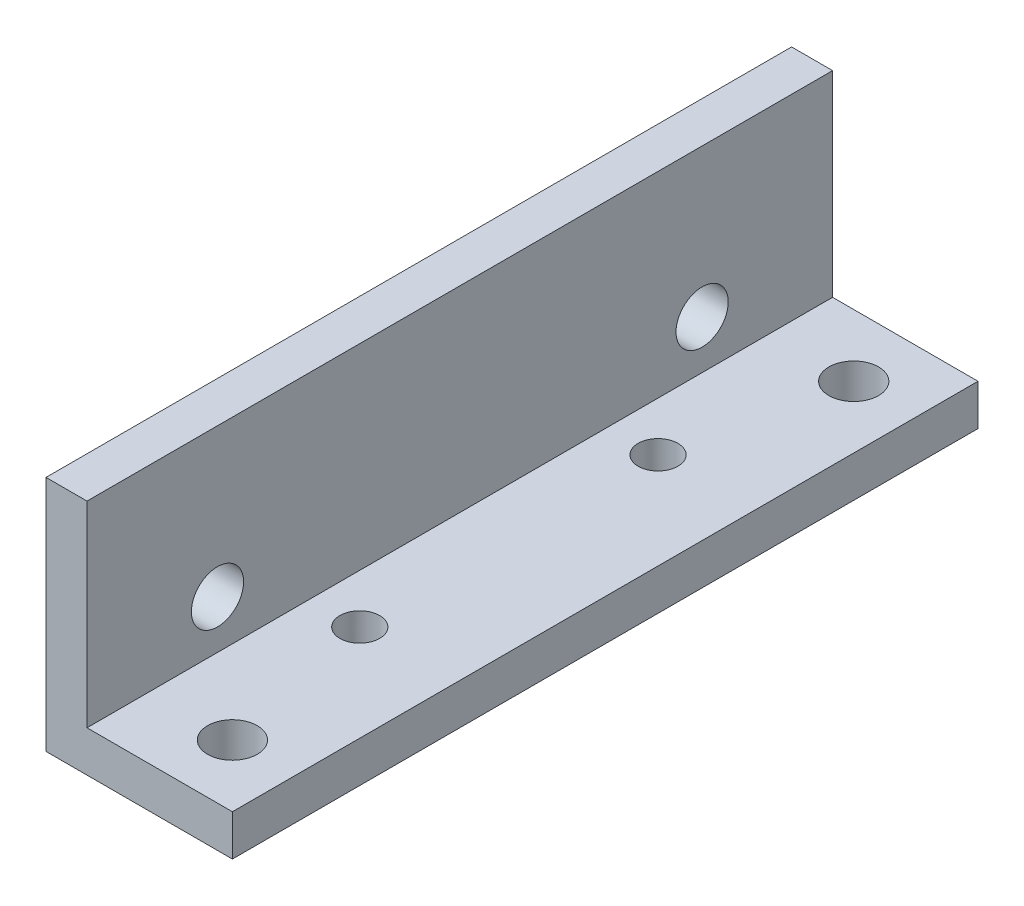
ISO-10303-21;
HEADER;
FILE_DESCRIPTION(('STEP AP214'),'2;1');
FILE_NAME('part.step','',(''),(''),'','','');
FILE_SCHEMA(('AUTOMOTIVE_DESIGN { 1 0 10303 214 1 1 1 1 }'));
ENDSEC;
DATA;
#1=APPLICATION_CONTEXT('core data for automotive mechanical design processes');
#2=APPLICATION_PROTOCOL_DEFINITION('international standard','automotive_design',2000,#1);
#3=PRODUCT_CONTEXT('',#1,'mechanical');
#4=PRODUCT('Part','Part','',(#3));
#5=PRODUCT_RELATED_PRODUCT_CATEGORY('part','',(#4));
#6=PRODUCT_DEFINITION_FORMATION('','',#4);
#7=PRODUCT_DEFINITION_CONTEXT('part definition',#1,'design');
#8=PRODUCT_DEFINITION('design','',#6,#7);
#9=PRODUCT_DEFINITION_SHAPE('','',#8);
#10=(LENGTH_UNIT() NAMED_UNIT(*) SI_UNIT(.MILLI.,.METRE.));
#11=(NAMED_UNIT(*) PLANE_ANGLE_UNIT() SI_UNIT($,.RADIAN.));
#12=(NAMED_UNIT(*) SI_UNIT($,.STERADIAN.) SOLID_ANGLE_UNIT());
#13=UNCERTAINTY_MEASURE_WITH_UNIT(LENGTH_MEASURE(1.E-05),#10,'distance_accuracy_value','');
#14=(GEOMETRIC_REPRESENTATION_CONTEXT(3) GLOBAL_UNCERTAINTY_ASSIGNED_CONTEXT((#13)) GLOBAL_UNIT_ASSIGNED_CONTEXT((#10,
#11,#12)) REPRESENTATION_CONTEXT('',''));
#15=CARTESIAN_POINT('',(0.,0.,0.));
#16=DIRECTION('',(0.,0.,1.));
#17=DIRECTION('',(1.,0.,0.));
#18=AXIS2_PLACEMENT_3D('',#15,#16,#17);
#19=CARTESIAN_POINT('',(19.1,0.,30.));
#20=DIRECTION('',(0.,1.,0.));
#21=DIRECTION('',(-1.,0.,0.));
#22=AXIS2_PLACEMENT_3D('',#19,#20,#21);
#23=PLANE('',#22);
#24=CARTESIAN_POINT('',(7.24999999999996,0.,11.9999999999999));
#25=DIRECTION('',(0.,-1.,0.));
#26=DIRECTION('',(1.,0.,0.));
#27=AXIS2_PLACEMENT_3D('',#24,#25,#26);
#28=CIRCLE('',#27,1.6);
#29=CARTESIAN_POINT('',(8.84999999999997,0.,11.9999999999999));
#30=VERTEX_POINT('',#29);
#31=EDGE_CURVE('E146',#30,#30,#28,.T.);
#32=ORIENTED_EDGE('',*,*,#31,.F.);
#33=EDGE_LOOP('',(#32));
#34=FACE_BOUND('',#33,.T.);
#35=CARTESIAN_POINT('',(7.24999999999992,0.,-12.0000000000001));
#36=DIRECTION('',(0.,-1.,0.));
#37=DIRECTION('',(1.,0.,0.));
#38=AXIS2_PLACEMENT_3D('',#35,#36,#37);
#39=CIRCLE('',#38,1.6);
#40=CARTESIAN_POINT('',(8.84999999999992,0.,-12.0000000000001));
#41=VERTEX_POINT('',#40);
#42=EDGE_CURVE('E135',#41,#41,#39,.T.);
#43=ORIENTED_EDGE('',*,*,#42,.F.);
#44=EDGE_LOOP('',(#43));
#45=FACE_BOUND('',#44,.T.);
#46=CARTESIAN_POINT('',(10.,0.,-25.));
#47=DIRECTION('',(0.,-1.,0.));
#48=DIRECTION('',(0.,0.,-1.));
#49=AXIS2_PLACEMENT_3D('',#46,#47,#48);
#50=CIRCLE('',#49,2.);
#51=CARTESIAN_POINT('',(10.,0.,-27.));
#52=VERTEX_POINT('',#51);
#53=EDGE_CURVE('E151',#52,#52,#50,.T.);
#54=ORIENTED_EDGE('',*,*,#53,.F.);
#55=EDGE_LOOP('',(#54));
#56=FACE_BOUND('',#55,.T.);
#57=DIRECTION('',(1.,0.,0.));
#58=VECTOR('',#57,1.);
#59=CARTESIAN_POINT('',(19.1,0.,-30.));
#60=LINE('',#59,#58);
#61=CARTESIAN_POINT('',(0.,0.,-30.));
#62=VERTEX_POINT('',#61);
#63=CARTESIAN_POINT('',(15.,0.,-30.));
#64=VERTEX_POINT('',#63);
#65=EDGE_CURVE('E103',#62,#64,#60,.T.);
#66=ORIENTED_EDGE('',*,*,#65,.T.);
#67=DIRECTION('',(0.,0.,-1.));
#68=VECTOR('',#67,1.);
#69=CARTESIAN_POINT('',(15.,0.,30.));
#70=LINE('',#69,#68);
#71=CARTESIAN_POINT('',(15.,0.,30.));
#72=VERTEX_POINT('',#71);
#73=EDGE_CURVE('E47',#72,#64,#70,.T.);
#74=ORIENTED_EDGE('',*,*,#73,.F.);
#75=DIRECTION('',(1.,0.,0.));
#76=VECTOR('',#75,1.);
#77=CARTESIAN_POINT('',(19.1,0.,30.));
#78=LINE('',#77,#76);
#79=CARTESIAN_POINT('',(0.,0.,30.));
#80=VERTEX_POINT('',#79);
#81=EDGE_CURVE('E101',#80,#72,#78,.T.);
#82=ORIENTED_EDGE('',*,*,#81,.F.);
#83=DIRECTION('',(0.,0.,-1.));
#84=VECTOR('',#83,1.);
#85=CARTESIAN_POINT('',(0.,0.,30.));
#86=LINE('',#85,#84);
#87=EDGE_CURVE('E118',#80,#62,#86,.T.);
#88=ORIENTED_EDGE('',*,*,#87,.T.);
#89=EDGE_LOOP('',(#66,#74,#82,#88));
#90=FACE_BOUND('',#89,.T.);
#91=CARTESIAN_POINT('',(10.,0.,25.));
#92=DIRECTION('',(0.,-1.,0.));
#93=DIRECTION('',(0.,0.,-1.));
#94=AXIS2_PLACEMENT_3D('',#91,#92,#93);
#95=CIRCLE('',#94,2.);
#96=CARTESIAN_POINT('',(10.,0.,23.));
#97=VERTEX_POINT('',#96);
#98=EDGE_CURVE('E134',#97,#97,#95,.T.);
#99=ORIENTED_EDGE('',*,*,#98,.F.);
#100=EDGE_LOOP('',(#99));
#101=FACE_BOUND('',#100,.T.);
#102=ADVANCED_FACE('F32',(#34,#45,#56,#90,#101),#23,.F.);
#103=CARTESIAN_POINT('',(3.3,3.3,30.));
#104=DIRECTION('',(0.,-1.,0.));
#105=DIRECTION('',(0.,0.,-1.));
#106=AXIS2_PLACEMENT_3D('',#103,#104,#105);
#107=PLANE('',#106);
#108=CARTESIAN_POINT('',(7.24999999999996,3.3,11.9999999999999));
#109=DIRECTION('',(0.,-1.,0.));
#110=DIRECTION('',(0.,0.,-1.));
#111=AXIS2_PLACEMENT_3D('',#108,#109,#110);
#112=CIRCLE('',#111,1.6);
#113=CARTESIAN_POINT('',(7.24999999999996,3.3,10.3999999999999));
#114=VERTEX_POINT('',#113);
#115=EDGE_CURVE('E35',#114,#114,#112,.T.);
#116=ORIENTED_EDGE('',*,*,#115,.T.);
#117=EDGE_LOOP('',(#116));
#118=FACE_BOUND('',#117,.T.);
#119=CARTESIAN_POINT('',(7.24999999999992,3.3,-12.0000000000001));
#120=DIRECTION('',(0.,-1.,0.));
#121=DIRECTION('',(0.,0.,-1.));
#122=AXIS2_PLACEMENT_3D('',#119,#120,#121);
#123=CIRCLE('',#122,1.6);
#124=CARTESIAN_POINT('',(7.24999999999992,3.3,-13.6000000000001));
#125=VERTEX_POINT('',#124);
#126=EDGE_CURVE('E132',#125,#125,#123,.T.);
#127=ORIENTED_EDGE('',*,*,#126,.T.);
#128=EDGE_LOOP('',(#127));
#129=FACE_BOUND('',#128,.T.);
#130=CARTESIAN_POINT('',(10.,3.3,25.));
#131=DIRECTION('',(0.,-1.,0.));
#132=DIRECTION('',(0.,0.,-1.));
#133=AXIS2_PLACEMENT_3D('',#130,#131,#132);
#134=CIRCLE('',#133,2.);
#135=CARTESIAN_POINT('',(10.,3.3,23.));
#136=VERTEX_POINT('',#135);
#137=EDGE_CURVE('E139',#136,#136,#134,.T.);
#138=ORIENTED_EDGE('',*,*,#137,.T.);
#139=EDGE_LOOP('',(#138));
#140=FACE_BOUND('',#139,.T.);
#141=CARTESIAN_POINT('',(10.,3.3,-25.));
#142=DIRECTION('',(0.,-1.,0.));
#143=DIRECTION('',(0.,0.,-1.));
#144=AXIS2_PLACEMENT_3D('',#141,#142,#143);
#145=CIRCLE('',#144,2.);
#146=CARTESIAN_POINT('',(10.,3.3,-27.));
#147=VERTEX_POINT('',#146);
#148=EDGE_CURVE('E154',#147,#147,#145,.T.);
#149=ORIENTED_EDGE('',*,*,#148,.T.);
#150=EDGE_LOOP('',(#149));
#151=FACE_BOUND('',#150,.T.);
#152=DIRECTION('',(-1.,0.,0.));
#153=VECTOR('',#152,1.);
#154=CARTESIAN_POINT('',(3.3,3.3,30.));
#155=LINE('',#154,#153);
#156=CARTESIAN_POINT('',(15.,3.3,30.));
#157=VERTEX_POINT('',#156);
#158=CARTESIAN_POINT('',(3.3,3.3,30.));
#159=VERTEX_POINT('',#158);
#160=EDGE_CURVE('E84',#157,#159,#155,.T.);
#161=ORIENTED_EDGE('',*,*,#160,.F.);
#162=DIRECTION('',(0.,0.,-1.));
#163=VECTOR('',#162,1.);
#164=CARTESIAN_POINT('',(15.,3.3,30.));
#165=LINE('',#164,#163);
#166=CARTESIAN_POINT('',(15.,3.3,-30.));
#167=VERTEX_POINT('',#166);
#168=EDGE_CURVE('E95',#157,#167,#165,.T.);
#169=ORIENTED_EDGE('',*,*,#168,.T.);
#170=DIRECTION('',(-1.,0.,0.));
#171=VECTOR('',#170,1.);
#172=CARTESIAN_POINT('',(3.3,3.3,-30.));
#173=LINE('',#172,#171);
#174=CARTESIAN_POINT('',(3.3,3.3,-30.));
#175=VERTEX_POINT('',#174);
#176=EDGE_CURVE('E120',#167,#175,#173,.T.);
#177=ORIENTED_EDGE('',*,*,#176,.T.);
#178=DIRECTION('',(0.,0.,-1.));
#179=VECTOR('',#178,1.);
#180=CARTESIAN_POINT('',(3.3,3.3,30.));
#181=LINE('',#180,#179);
#182=EDGE_CURVE('E40',#159,#175,#181,.T.);
#183=ORIENTED_EDGE('',*,*,#182,.F.);
#184=EDGE_LOOP('',(#161,#169,#177,#183));
#185=FACE_BOUND('',#184,.T.);
#186=ADVANCED_FACE('F187',(#118,#129,#140,#151,#185),#107,.F.);
#187=CARTESIAN_POINT('',(3.3,19.1,30.));
#188=DIRECTION('',(-1.,0.,0.));
#189=DIRECTION('',(0.,-1.,0.));
#190=AXIS2_PLACEMENT_3D('',#187,#188,#189);
#191=PLANE('',#190);
#192=CARTESIAN_POINT('',(3.3,7.18,-19.5));
#193=DIRECTION('',(-1.,0.,0.));
#194=DIRECTION('',(0.,-1.,0.));
#195=AXIS2_PLACEMENT_3D('',#192,#193,#194);
#196=CIRCLE('',#195,2.09999999999999);
#197=CARTESIAN_POINT('',(3.3,5.08000000000001,-19.5));
#198=VERTEX_POINT('',#197);
#199=EDGE_CURVE('E160',#198,#198,#196,.T.);
#200=ORIENTED_EDGE('',*,*,#199,.T.);
#201=EDGE_LOOP('',(#200));
#202=FACE_BOUND('',#201,.T.);
#203=CARTESIAN_POINT('',(3.3,7.18,19.5));
#204=DIRECTION('',(-1.,0.,0.));
#205=DIRECTION('',(0.,-1.,0.));
#206=AXIS2_PLACEMENT_3D('',#203,#204,#205);
#207=CIRCLE('',#206,2.09999999999999);
#208=CARTESIAN_POINT('',(3.3,5.08000000000001,19.5));
#209=VERTEX_POINT('',#208);
#210=EDGE_CURVE('E104',#209,#209,#207,.T.);
#211=ORIENTED_EDGE('',*,*,#210,.T.);
#212=EDGE_LOOP('',(#211));
#213=FACE_BOUND('',#212,.T.);
#214=DIRECTION('',(0.,1.,0.));
#215=VECTOR('',#214,1.);
#216=CARTESIAN_POINT('',(3.3,19.1,-30.));
#217=LINE('',#216,#215);
#218=CARTESIAN_POINT('',(3.3,19.1,-30.));
#219=VERTEX_POINT('',#218);
#220=EDGE_CURVE('E122',#175,#219,#217,.T.);
#221=ORIENTED_EDGE('',*,*,#220,.T.);
#222=DIRECTION('',(0.,0.,-1.));
#223=VECTOR('',#222,1.);
#224=CARTESIAN_POINT('',(3.3,19.1,30.));
#225=LINE('',#224,#223);
#226=CARTESIAN_POINT('',(3.3,19.1,30.));
#227=VERTEX_POINT('',#226);
#228=EDGE_CURVE('E128',#227,#219,#225,.T.);
#229=ORIENTED_EDGE('',*,*,#228,.F.);
#230=DIRECTION('',(0.,1.,0.));
#231=VECTOR('',#230,1.);
#232=CARTESIAN_POINT('',(3.3,19.1,30.));
#233=LINE('',#232,#231);
#234=EDGE_CURVE('E108',#159,#227,#233,.T.);
#235=ORIENTED_EDGE('',*,*,#234,.F.);
#236=ORIENTED_EDGE('',*,*,#182,.T.);
#237=EDGE_LOOP('',(#221,#229,#235,#236));
#238=FACE_BOUND('',#237,.T.);
#239=ADVANCED_FACE('F169',(#202,#213,#238),#191,.F.);
#240=CARTESIAN_POINT('',(0.,19.1,30.));
#241=DIRECTION('',(0.,-1.,0.));
#242=DIRECTION('',(0.,0.,-1.));
#243=AXIS2_PLACEMENT_3D('',#240,#241,#242);
#244=PLANE('',#243);
#245=DIRECTION('',(-1.,0.,0.));
#246=VECTOR('',#245,1.);
#247=CARTESIAN_POINT('',(0.,19.1,-30.));
#248=LINE('',#247,#246);
#249=CARTESIAN_POINT('',(0.,19.1,-30.));
#250=VERTEX_POINT('',#249);
#251=EDGE_CURVE('E110',#219,#250,#248,.T.);
#252=ORIENTED_EDGE('',*,*,#251,.T.);
#253=DIRECTION('',(0.,0.,-1.));
#254=VECTOR('',#253,1.);
#255=CARTESIAN_POINT('',(0.,19.1,30.));
#256=LINE('',#255,#254);
#257=CARTESIAN_POINT('',(0.,19.1,30.));
#258=VERTEX_POINT('',#257);
#259=EDGE_CURVE('E126',#258,#250,#256,.T.);
#260=ORIENTED_EDGE('',*,*,#259,.F.);
#261=DIRECTION('',(-1.,0.,0.));
#262=VECTOR('',#261,1.);
#263=CARTESIAN_POINT('',(0.,19.1,30.));
#264=LINE('',#263,#262);
#265=EDGE_CURVE('E115',#227,#258,#264,.T.);
#266=ORIENTED_EDGE('',*,*,#265,.F.);
#267=ORIENTED_EDGE('',*,*,#228,.T.);
#268=EDGE_LOOP('',(#252,#260,#266,#267));
#269=FACE_BOUND('',#268,.T.);
#270=ADVANCED_FACE('F231',(#269),#244,.F.);
#271=CARTESIAN_POINT('',(0.,0.,30.));
#272=DIRECTION('',(1.,0.,0.));
#273=DIRECTION('',(0.,0.,-1.));
#274=AXIS2_PLACEMENT_3D('',#271,#272,#273);
#275=PLANE('',#274);
#276=CARTESIAN_POINT('',(0.,7.18,-19.5));
#277=DIRECTION('',(-1.,0.,0.));
#278=DIRECTION('',(0.,0.,1.));
#279=AXIS2_PLACEMENT_3D('',#276,#277,#278);
#280=CIRCLE('',#279,2.09999999999999);
#281=CARTESIAN_POINT('',(0.,7.18,-17.4));
#282=VERTEX_POINT('',#281);
#283=EDGE_CURVE('E157',#282,#282,#280,.T.);
#284=ORIENTED_EDGE('',*,*,#283,.F.);
#285=EDGE_LOOP('',(#284));
#286=FACE_BOUND('',#285,.T.);
#287=CARTESIAN_POINT('',(0.,7.18,19.5));
#288=DIRECTION('',(-1.,0.,0.));
#289=DIRECTION('',(0.,0.,1.));
#290=AXIS2_PLACEMENT_3D('',#287,#288,#289);
#291=CIRCLE('',#290,2.09999999999999);
#292=CARTESIAN_POINT('',(0.,7.18,21.6));
#293=VERTEX_POINT('',#292);
#294=EDGE_CURVE('E163',#293,#293,#291,.T.);
#295=ORIENTED_EDGE('',*,*,#294,.F.);
#296=EDGE_LOOP('',(#295));
#297=FACE_BOUND('',#296,.T.);
#298=DIRECTION('',(0.,-1.,0.));
#299=VECTOR('',#298,1.);
#300=CARTESIAN_POINT('',(0.,0.,-30.));
#301=LINE('',#300,#299);
#302=EDGE_CURVE('E77',#250,#62,#301,.T.);
#303=ORIENTED_EDGE('',*,*,#302,.T.);
#304=ORIENTED_EDGE('',*,*,#87,.F.);
#305=DIRECTION('',(0.,-1.,0.));
#306=VECTOR('',#305,1.);
#307=CARTESIAN_POINT('',(0.,0.,30.));
#308=LINE('',#307,#306);
#309=EDGE_CURVE('E56',#258,#80,#308,.T.);
#310=ORIENTED_EDGE('',*,*,#309,.F.);
#311=ORIENTED_EDGE('',*,*,#259,.T.);
#312=EDGE_LOOP('',(#303,#304,#310,#311));
#313=FACE_BOUND('',#312,.T.);
#314=ADVANCED_FACE('F233',(#286,#297,#313),#275,.F.);
#315=CARTESIAN_POINT('',(0.,0.,30.));
#316=DIRECTION('',(0.,0.,-1.));
#317=DIRECTION('',(-1.,0.,0.));
#318=AXIS2_PLACEMENT_3D('',#315,#316,#317);
#319=PLANE('',#318);
#320=ORIENTED_EDGE('',*,*,#81,.T.);
#321=DIRECTION('',(0.,-1.,0.));
#322=VECTOR('',#321,1.);
#323=CARTESIAN_POINT('',(15.,19.1,30.));
#324=LINE('',#323,#322);
#325=EDGE_CURVE('E92',#157,#72,#324,.T.);
#326=ORIENTED_EDGE('',*,*,#325,.F.);
#327=ORIENTED_EDGE('',*,*,#160,.T.);
#328=ORIENTED_EDGE('',*,*,#234,.T.);
#329=ORIENTED_EDGE('',*,*,#265,.T.);
#330=ORIENTED_EDGE('',*,*,#309,.T.);
#331=EDGE_LOOP('',(#320,#326,#327,#328,#329,#330));
#332=FACE_BOUND('',#331,.T.);
#333=ADVANCED_FACE('F106',(#332),#319,.F.);
#334=CARTESIAN_POINT('',(0.,0.,-30.));
#335=DIRECTION('',(0.,0.,-1.));
#336=DIRECTION('',(-1.,0.,0.));
#337=AXIS2_PLACEMENT_3D('',#334,#335,#336);
#338=PLANE('',#337);
#339=DIRECTION('',(0.,1.,0.));
#340=VECTOR('',#339,1.);
#341=CARTESIAN_POINT('',(15.,0.,-30.));
#342=LINE('',#341,#340);
#343=EDGE_CURVE('E11',#64,#167,#342,.T.);
#344=ORIENTED_EDGE('',*,*,#343,.F.);
#345=ORIENTED_EDGE('',*,*,#65,.F.);
#346=ORIENTED_EDGE('',*,*,#302,.F.);
#347=ORIENTED_EDGE('',*,*,#251,.F.);
#348=ORIENTED_EDGE('',*,*,#220,.F.);
#349=ORIENTED_EDGE('',*,*,#176,.F.);
#350=EDGE_LOOP('',(#344,#345,#346,#347,#348,#349));
#351=FACE_BOUND('',#350,.T.);
#352=ADVANCED_FACE('F184',(#351),#338,.T.);
#353=CARTESIAN_POINT('',(15.,19.1,30.));
#354=DIRECTION('',(-1.,0.,0.));
#355=DIRECTION('',(0.,0.,1.));
#356=AXIS2_PLACEMENT_3D('',#353,#354,#355);
#357=PLANE('',#356);
#358=ORIENTED_EDGE('',*,*,#325,.T.);
#359=ORIENTED_EDGE('',*,*,#73,.T.);
#360=ORIENTED_EDGE('',*,*,#343,.T.);
#361=ORIENTED_EDGE('',*,*,#168,.F.);
#362=EDGE_LOOP('',(#358,#359,#360,#361));
#363=FACE_BOUND('',#362,.T.);
#364=ADVANCED_FACE('F93',(#363),#357,.F.);
#365=CARTESIAN_POINT('',(0.,7.18,19.5));
#366=DIRECTION('',(-1.,0.,0.));
#367=DIRECTION('',(0.,0.,1.));
#368=AXIS2_PLACEMENT_3D('',#365,#366,#367);
#369=CYLINDRICAL_SURFACE('',#368,2.09999999999999);
#370=ORIENTED_EDGE('',*,*,#294,.T.);
#371=EDGE_LOOP('',(#370));
#372=FACE_BOUND('',#371,.T.);
#373=ORIENTED_EDGE('',*,*,#210,.F.);
#374=EDGE_LOOP('',(#373));
#375=FACE_BOUND('',#374,.T.);
#376=ADVANCED_FACE('F172',(#372,#375),#369,.F.);
#377=CARTESIAN_POINT('',(0.,7.18,-19.5));
#378=DIRECTION('',(-1.,0.,0.));
#379=DIRECTION('',(0.,0.,1.));
#380=AXIS2_PLACEMENT_3D('',#377,#378,#379);
#381=CYLINDRICAL_SURFACE('',#380,2.09999999999999);
#382=ORIENTED_EDGE('',*,*,#283,.T.);
#383=EDGE_LOOP('',(#382));
#384=FACE_BOUND('',#383,.T.);
#385=ORIENTED_EDGE('',*,*,#199,.F.);
#386=EDGE_LOOP('',(#385));
#387=FACE_BOUND('',#386,.T.);
#388=ADVANCED_FACE('F174',(#384,#387),#381,.F.);
#389=CARTESIAN_POINT('',(10.,0.,-25.));
#390=DIRECTION('',(0.,-1.,0.));
#391=DIRECTION('',(0.,0.,-1.));
#392=AXIS2_PLACEMENT_3D('',#389,#390,#391);
#393=CYLINDRICAL_SURFACE('',#392,2.);
#394=ORIENTED_EDGE('',*,*,#148,.F.);
#395=EDGE_LOOP('',(#394));
#396=FACE_BOUND('',#395,.T.);
#397=ORIENTED_EDGE('',*,*,#53,.T.);
#398=EDGE_LOOP('',(#397));
#399=FACE_BOUND('',#398,.T.);
#400=ADVANCED_FACE('F181',(#396,#399),#393,.F.);
#401=CARTESIAN_POINT('',(10.,0.,25.));
#402=DIRECTION('',(0.,-1.,0.));
#403=DIRECTION('',(0.,0.,-1.));
#404=AXIS2_PLACEMENT_3D('',#401,#402,#403);
#405=CYLINDRICAL_SURFACE('',#404,2.);
#406=ORIENTED_EDGE('',*,*,#137,.F.);
#407=EDGE_LOOP('',(#406));
#408=FACE_BOUND('',#407,.T.);
#409=ORIENTED_EDGE('',*,*,#98,.T.);
#410=EDGE_LOOP('',(#409));
#411=FACE_BOUND('',#410,.T.);
#412=ADVANCED_FACE('F200',(#408,#411),#405,.F.);
#413=CARTESIAN_POINT('',(7.24999999999992,19.1,-12.0000000000001));
#414=DIRECTION('',(0.,-1.,0.));
#415=DIRECTION('',(1.,0.,0.));
#416=AXIS2_PLACEMENT_3D('',#413,#414,#415);
#417=CYLINDRICAL_SURFACE('',#416,1.6);
#418=ORIENTED_EDGE('',*,*,#42,.T.);
#419=EDGE_LOOP('',(#418));
#420=FACE_BOUND('',#419,.T.);
#421=ORIENTED_EDGE('',*,*,#126,.F.);
#422=EDGE_LOOP('',(#421));
#423=FACE_BOUND('',#422,.T.);
#424=ADVANCED_FACE('F206',(#420,#423),#417,.F.);
#425=CARTESIAN_POINT('',(7.24999999999997,19.1,11.9999999999999));
#426=DIRECTION('',(0.,-1.,0.));
#427=DIRECTION('',(1.,0.,0.));
#428=AXIS2_PLACEMENT_3D('',#425,#426,#427);
#429=CYLINDRICAL_SURFACE('',#428,1.6);
#430=ORIENTED_EDGE('',*,*,#31,.T.);
#431=EDGE_LOOP('',(#430));
#432=FACE_BOUND('',#431,.T.);
#433=ORIENTED_EDGE('',*,*,#115,.F.);
#434=EDGE_LOOP('',(#433));
#435=FACE_BOUND('',#434,.T.);
#436=ADVANCED_FACE('F213',(#432,#435),#429,.F.);
#437=CLOSED_SHELL('',(#102,#186,#239,#270,#314,#333,#352,#364,#376,#388,#400,#412,#424,#436));
#438=MANIFOLD_SOLID_BREP('B2',#437);
#439=ADVANCED_BREP_SHAPE_REPRESENTATION('',(#18,#438),#14);
#440=SHAPE_DEFINITION_REPRESENTATION(#9,#439);
ENDSEC;
END-ISO-10303-21;
